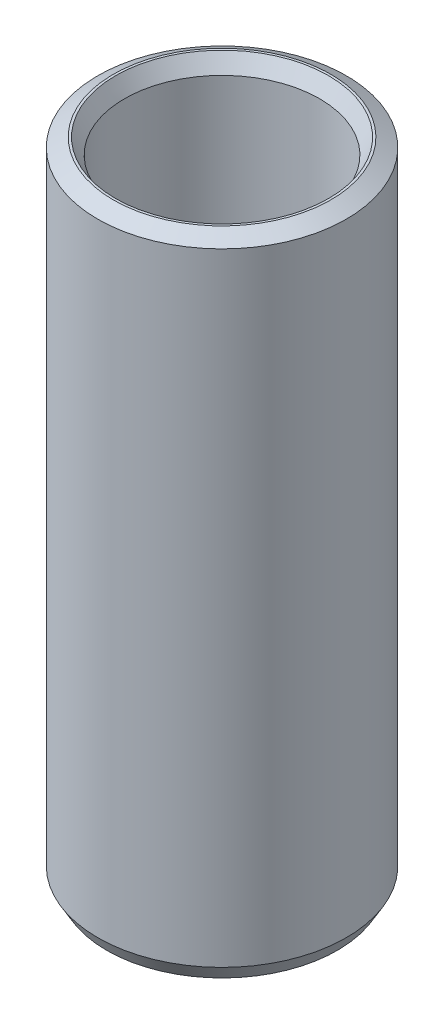
ISO-10303-21;
HEADER;
FILE_DESCRIPTION(('STEP AP214'),'2;1');
FILE_NAME('part.step','',(''),(''),'','','');
FILE_SCHEMA(('AUTOMOTIVE_DESIGN { 1 0 10303 214 1 1 1 1 }'));
ENDSEC;
DATA;
#1=APPLICATION_CONTEXT('core data for automotive mechanical design processes');
#2=APPLICATION_PROTOCOL_DEFINITION('international standard','automotive_design',2000,#1);
#3=PRODUCT_CONTEXT('',#1,'mechanical');
#4=PRODUCT('Part','Part','',(#3));
#5=PRODUCT_RELATED_PRODUCT_CATEGORY('part','',(#4));
#6=PRODUCT_DEFINITION_FORMATION('','',#4);
#7=PRODUCT_DEFINITION_CONTEXT('part definition',#1,'design');
#8=PRODUCT_DEFINITION('design','',#6,#7);
#9=PRODUCT_DEFINITION_SHAPE('','',#8);
#10=(LENGTH_UNIT() NAMED_UNIT(*) SI_UNIT(.MILLI.,.METRE.));
#11=(NAMED_UNIT(*) PLANE_ANGLE_UNIT() SI_UNIT($,.RADIAN.));
#12=(NAMED_UNIT(*) SI_UNIT($,.STERADIAN.) SOLID_ANGLE_UNIT());
#13=UNCERTAINTY_MEASURE_WITH_UNIT(LENGTH_MEASURE(1.E-05),#10,'distance_accuracy_value','');
#14=(GEOMETRIC_REPRESENTATION_CONTEXT(3) GLOBAL_UNCERTAINTY_ASSIGNED_CONTEXT((#13)) GLOBAL_UNIT_ASSIGNED_CONTEXT((#10,
#11,#12)) REPRESENTATION_CONTEXT('',''));
#15=CARTESIAN_POINT('',(0.,0.,0.));
#16=DIRECTION('',(0.,0.,1.));
#17=DIRECTION('',(1.,0.,0.));
#18=AXIS2_PLACEMENT_3D('',#15,#16,#17);
#19=CARTESIAN_POINT('',(0.,182.095526753748,0.));
#20=DIRECTION('',(0.,-1.,0.));
#21=DIRECTION('',(0.,0.,-1.));
#22=AXIS2_PLACEMENT_3D('',#19,#20,#21);
#23=CYLINDRICAL_SURFACE('',#22,35.);
#24=CARTESIAN_POINT('',(0.,4.36211500448205,0.));
#25=DIRECTION('',(0.,1.,0.));
#26=DIRECTION('',(0.,0.,1.));
#27=AXIS2_PLACEMENT_3D('',#24,#25,#26);
#28=CIRCLE('',#27,35.);
#29=CARTESIAN_POINT('',(0.,4.36211500448205,35.));
#30=VERTEX_POINT('',#29);
#31=EDGE_CURVE('E10',#30,#30,#28,.T.);
#32=ORIENTED_EDGE('',*,*,#31,.T.);
#33=EDGE_LOOP('',(#32));
#34=FACE_BOUND('',#33,.T.);
#35=CARTESIAN_POINT('',(0.,179.577058481674,0.));
#36=DIRECTION('',(0.,1.,0.));
#37=DIRECTION('',(0.,0.,1.));
#38=AXIS2_PLACEMENT_3D('',#35,#36,#37);
#39=CIRCLE('',#38,35.);
#40=CARTESIAN_POINT('',(0.,179.577058481674,35.));
#41=VERTEX_POINT('',#40);
#42=EDGE_CURVE('E50',#41,#41,#39,.F.);
#43=ORIENTED_EDGE('',*,*,#42,.T.);
#44=EDGE_LOOP('',(#43));
#45=FACE_BOUND('',#44,.T.);
#46=ADVANCED_FACE('F39',(#34,#45),#23,.T.);
#47=CARTESIAN_POINT('',(0.,182.095526753748,0.));
#48=DIRECTION('',(0.,1.,0.));
#49=DIRECTION('',(0.,0.,1.));
#50=AXIS2_PLACEMENT_3D('',#47,#48,#49);
#51=PLANE('',#50);
#52=CARTESIAN_POINT('',(0.,182.095526753748,0.));
#53=DIRECTION('',(0.,1.,0.));
#54=DIRECTION('',(0.,0.,1.));
#55=AXIS2_PLACEMENT_3D('',#52,#53,#54);
#56=CIRCLE('',#55,29.9809402364165);
#57=CARTESIAN_POINT('',(0.,182.095526753748,29.9809402364165));
#58=VERTEX_POINT('',#57);
#59=EDGE_CURVE('E58',#58,#58,#56,.F.);
#60=ORIENTED_EDGE('',*,*,#59,.T.);
#61=EDGE_LOOP('',(#60));
#62=FACE_BOUND('',#61,.T.);
#63=CARTESIAN_POINT('',(0.,182.095526753748,0.));
#64=DIRECTION('',(0.,1.,0.));
#65=DIRECTION('',(0.,0.,1.));
#66=AXIS2_PLACEMENT_3D('',#63,#64,#65);
#67=CIRCLE('',#66,30.6378849955178);
#68=CARTESIAN_POINT('',(0.,182.095526753748,30.6378849955178));
#69=VERTEX_POINT('',#68);
#70=EDGE_CURVE('E61',#69,#69,#67,.T.);
#71=ORIENTED_EDGE('',*,*,#70,.T.);
#72=EDGE_LOOP('',(#71));
#73=FACE_BOUND('',#72,.T.);
#74=ADVANCED_FACE('F88',(#62,#73),#51,.T.);
#75=CARTESIAN_POINT('',(0.,0.,0.));
#76=DIRECTION('',(0.,1.,0.));
#77=DIRECTION('',(0.,0.,1.));
#78=AXIS2_PLACEMENT_3D('',#75,#76,#77);
#79=PLANE('',#78);
#80=CARTESIAN_POINT('',(0.,0.,0.));
#81=DIRECTION('',(0.,1.,0.));
#82=DIRECTION('',(0.,0.,1.));
#83=AXIS2_PLACEMENT_3D('',#80,#81,#82);
#84=CIRCLE('',#83,31.8245869688247);
#85=CARTESIAN_POINT('',(0.,0.,31.8245869688247));
#86=VERTEX_POINT('',#85);
#87=EDGE_CURVE('E51',#86,#86,#84,.T.);
#88=ORIENTED_EDGE('',*,*,#87,.T.);
#89=EDGE_LOOP('',(#88));
#90=FACE_BOUND('',#89,.T.);
#91=CARTESIAN_POINT('',(0.,0.,0.));
#92=DIRECTION('',(0.,1.,0.));
#93=DIRECTION('',(0.,0.,1.));
#94=AXIS2_PLACEMENT_3D('',#91,#92,#93);
#95=CIRCLE('',#94,32.4815317279262);
#96=CARTESIAN_POINT('',(0.,0.,32.4815317279262));
#97=VERTEX_POINT('',#96);
#98=EDGE_CURVE('E54',#97,#97,#95,.F.);
#99=ORIENTED_EDGE('',*,*,#98,.T.);
#100=EDGE_LOOP('',(#99));
#101=FACE_BOUND('',#100,.T.);
#102=ADVANCED_FACE('F83',(#90,#101),#79,.F.);
#103=CARTESIAN_POINT('',(0.,182.095526753748,0.));
#104=DIRECTION('',(0.,-1.,0.));
#105=DIRECTION('',(0.,0.,-1.));
#106=AXIS2_PLACEMENT_3D('',#103,#104,#105);
#107=CYLINDRICAL_SURFACE('',#106,27.4624719643426);
#108=CARTESIAN_POINT('',(0.,177.733411749266,0.));
#109=DIRECTION('',(0.,1.,0.));
#110=DIRECTION('',(0.,0.,1.));
#111=AXIS2_PLACEMENT_3D('',#108,#109,#110);
#112=CIRCLE('',#111,27.4624719643426);
#113=CARTESIAN_POINT('',(0.,177.733411749266,27.4624719643426));
#114=VERTEX_POINT('',#113);
#115=EDGE_CURVE('E67',#114,#114,#112,.T.);
#116=ORIENTED_EDGE('',*,*,#115,.T.);
#117=EDGE_LOOP('',(#116));
#118=FACE_BOUND('',#117,.T.);
#119=CARTESIAN_POINT('',(0.,2.51846827207391,0.));
#120=DIRECTION('',(0.,1.,0.));
#121=DIRECTION('',(0.,0.,1.));
#122=AXIS2_PLACEMENT_3D('',#119,#120,#121);
#123=CIRCLE('',#122,27.4624719643426);
#124=CARTESIAN_POINT('',(0.,2.51846827207391,27.4624719643426));
#125=VERTEX_POINT('',#124);
#126=EDGE_CURVE('E69',#125,#125,#123,.F.);
#127=ORIENTED_EDGE('',*,*,#126,.T.);
#128=EDGE_LOOP('',(#127));
#129=FACE_BOUND('',#128,.T.);
#130=ADVANCED_FACE('F71',(#118,#129),#107,.F.);
#131=CARTESIAN_POINT('',(0.,177.733411749266,0.));
#132=DIRECTION('',(0.,1.,0.));
#133=DIRECTION('',(0.,0.,1.));
#134=AXIS2_PLACEMENT_3D('',#131,#132,#133);
#135=CONICAL_SURFACE('',#134,27.4624719643426,0.523598775598297);
#136=ORIENTED_EDGE('',*,*,#59,.F.);
#137=EDGE_LOOP('',(#136));
#138=FACE_BOUND('',#137,.T.);
#139=ORIENTED_EDGE('',*,*,#115,.F.);
#140=EDGE_LOOP('',(#139));
#141=FACE_BOUND('',#140,.T.);
#142=ADVANCED_FACE('F77',(#138,#141),#135,.F.);
#143=CARTESIAN_POINT('',(0.,0.,0.));
#144=DIRECTION('',(0.,-1.,0.));
#145=DIRECTION('',(0.,0.,-1.));
#146=AXIS2_PLACEMENT_3D('',#143,#144,#145);
#147=CONICAL_SURFACE('',#146,31.8245869688247,1.04719755119659);
#148=ORIENTED_EDGE('',*,*,#126,.F.);
#149=EDGE_LOOP('',(#148));
#150=FACE_BOUND('',#149,.T.);
#151=ORIENTED_EDGE('',*,*,#87,.F.);
#152=EDGE_LOOP('',(#151));
#153=FACE_BOUND('',#152,.T.);
#154=ADVANCED_FACE('F73',(#150,#153),#147,.F.);
#155=CARTESIAN_POINT('',(0.,4.36211500448205,0.));
#156=DIRECTION('',(0.,1.,0.));
#157=DIRECTION('',(0.,0.,1.));
#158=AXIS2_PLACEMENT_3D('',#155,#156,#157);
#159=CONICAL_SURFACE('',#158,35.,0.523598775598302);
#160=ORIENTED_EDGE('',*,*,#98,.F.);
#161=EDGE_LOOP('',(#160));
#162=FACE_BOUND('',#161,.T.);
#163=ORIENTED_EDGE('',*,*,#31,.F.);
#164=EDGE_LOOP('',(#163));
#165=FACE_BOUND('',#164,.T.);
#166=ADVANCED_FACE('F76',(#162,#165),#159,.T.);
#167=CARTESIAN_POINT('',(0.,182.095526753748,0.));
#168=DIRECTION('',(0.,-1.,0.));
#169=DIRECTION('',(0.,0.,-1.));
#170=AXIS2_PLACEMENT_3D('',#167,#168,#169);
#171=CONICAL_SURFACE('',#170,30.6378849955178,1.0471975511966);
#172=ORIENTED_EDGE('',*,*,#42,.F.);
#173=EDGE_LOOP('',(#172));
#174=FACE_BOUND('',#173,.T.);
#175=ORIENTED_EDGE('',*,*,#70,.F.);
#176=EDGE_LOOP('',(#175));
#177=FACE_BOUND('',#176,.T.);
#178=ADVANCED_FACE('F45',(#174,#177),#171,.T.);
#179=CLOSED_SHELL('',(#46,#74,#102,#130,#142,#154,#166,#178));
#180=MANIFOLD_SOLID_BREP('B2',#179);
#181=ADVANCED_BREP_SHAPE_REPRESENTATION('',(#18,#180),#14);
#182=SHAPE_DEFINITION_REPRESENTATION(#9,#181);
ENDSEC;
END-ISO-10303-21;
